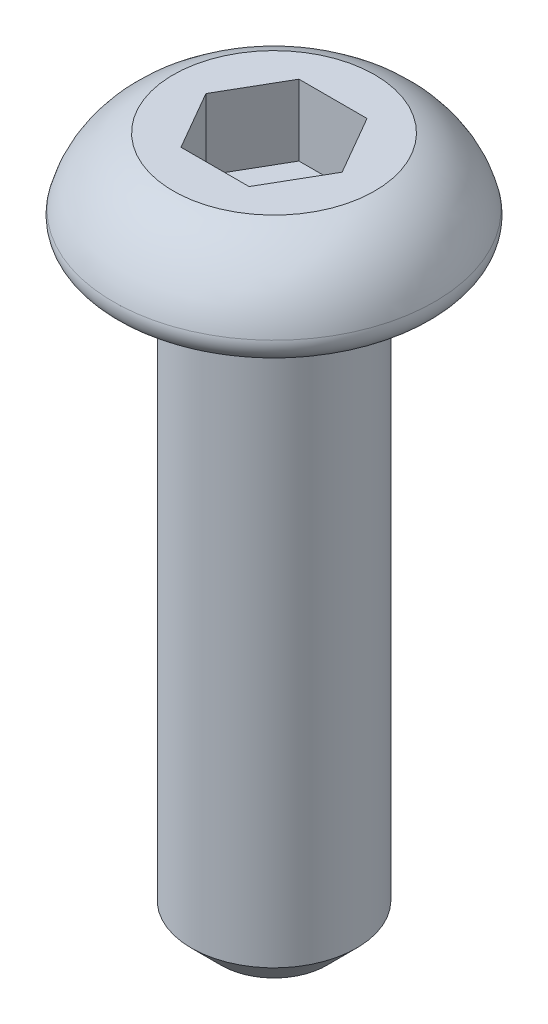
ISO-10303-21;
HEADER;
FILE_DESCRIPTION(('STEP AP214'),'2;1');
FILE_NAME('part.step','',(''),(''),'','','');
FILE_SCHEMA(('AUTOMOTIVE_DESIGN { 1 0 10303 214 1 1 1 1 }'));
ENDSEC;
DATA;
#1=APPLICATION_CONTEXT('core data for automotive mechanical design processes');
#2=APPLICATION_PROTOCOL_DEFINITION('international standard','automotive_design',2000,#1);
#3=PRODUCT_CONTEXT('',#1,'mechanical');
#4=PRODUCT('Part','Part','',(#3));
#5=PRODUCT_RELATED_PRODUCT_CATEGORY('part','',(#4));
#6=PRODUCT_DEFINITION_FORMATION('','',#4);
#7=PRODUCT_DEFINITION_CONTEXT('part definition',#1,'design');
#8=PRODUCT_DEFINITION('design','',#6,#7);
#9=PRODUCT_DEFINITION_SHAPE('','',#8);
#10=(LENGTH_UNIT() NAMED_UNIT(*) SI_UNIT(.MILLI.,.METRE.));
#11=(NAMED_UNIT(*) PLANE_ANGLE_UNIT() SI_UNIT($,.RADIAN.));
#12=(NAMED_UNIT(*) SI_UNIT($,.STERADIAN.) SOLID_ANGLE_UNIT());
#13=UNCERTAINTY_MEASURE_WITH_UNIT(LENGTH_MEASURE(1.E-05),#10,'distance_accuracy_value','');
#14=(GEOMETRIC_REPRESENTATION_CONTEXT(3) GLOBAL_UNCERTAINTY_ASSIGNED_CONTEXT((#13)) GLOBAL_UNIT_ASSIGNED_CONTEXT((#10,
#11,#12)) REPRESENTATION_CONTEXT('',''));
#15=CARTESIAN_POINT('',(0.,0.,0.));
#16=DIRECTION('',(0.,0.,1.));
#17=DIRECTION('',(1.,0.,0.));
#18=AXIS2_PLACEMENT_3D('',#15,#16,#17);
#19=CARTESIAN_POINT('',(0.,0.304800000000001,0.));
#20=DIRECTION('',(0.,1.,0.));
#21=DIRECTION('',(-1.,0.,0.));
#22=AXIS2_PLACEMENT_3D('',#19,#20,#21);
#23=PLANE('',#22);
#24=DIRECTION('',(-0.5,0.,0.866025403784439));
#25=VECTOR('',#24,1.);
#26=CARTESIAN_POINT('',(-0.536574999999999,0.304800000000001,-0.92937516207127));
#27=LINE('',#26,#25);
#28=CARTESIAN_POINT('',(-0.536574999999999,0.304800000000001,-0.929375162071269));
#29=VERTEX_POINT('',#28);
#30=CARTESIAN_POINT('',(-1.07315,0.304800000000001,0.));
#31=VERTEX_POINT('',#30);
#32=EDGE_CURVE('E148',#29,#31,#27,.T.);
#33=ORIENTED_EDGE('',*,*,#32,.T.);
#34=DIRECTION('',(0.5,0.,0.866025403784439));
#35=VECTOR('',#34,1.);
#36=CARTESIAN_POINT('',(-1.07315,0.304800000000001,0.));
#37=LINE('',#36,#35);
#38=CARTESIAN_POINT('',(-0.536575000000001,0.304800000000001,0.92937516207127));
#39=VERTEX_POINT('',#38);
#40=EDGE_CURVE('E143',#31,#39,#37,.T.);
#41=ORIENTED_EDGE('',*,*,#40,.T.);
#42=DIRECTION('',(1.,0.,0.));
#43=VECTOR('',#42,1.);
#44=CARTESIAN_POINT('',(-0.536574999999999,0.304800000000001,0.929375162071269));
#45=LINE('',#44,#43);
#46=CARTESIAN_POINT('',(0.536574999999999,0.304800000000001,0.929375162071269));
#47=VERTEX_POINT('',#46);
#48=EDGE_CURVE('E82',#39,#47,#45,.T.);
#49=ORIENTED_EDGE('',*,*,#48,.T.);
#50=DIRECTION('',(0.5,0.,-0.866025403784439));
#51=VECTOR('',#50,1.);
#52=CARTESIAN_POINT('',(0.536574999999999,0.304800000000001,0.929375162071269));
#53=LINE('',#52,#51);
#54=CARTESIAN_POINT('',(1.07315,0.304800000000001,0.));
#55=VERTEX_POINT('',#54);
#56=EDGE_CURVE('E79',#47,#55,#53,.T.);
#57=ORIENTED_EDGE('',*,*,#56,.T.);
#58=DIRECTION('',(-0.5,0.,-0.866025403784439));
#59=VECTOR('',#58,1.);
#60=CARTESIAN_POINT('',(1.07315,0.304800000000001,0.));
#61=LINE('',#60,#59);
#62=CARTESIAN_POINT('',(0.536575000000001,0.304800000000001,-0.929375162071269));
#63=VERTEX_POINT('',#62);
#64=EDGE_CURVE('E76',#55,#63,#61,.T.);
#65=ORIENTED_EDGE('',*,*,#64,.T.);
#66=DIRECTION('',(-1.,0.,0.));
#67=VECTOR('',#66,1.);
#68=CARTESIAN_POINT('',(0.536574999999999,0.304800000000001,-0.929375162071269));
#69=LINE('',#68,#67);
#70=EDGE_CURVE('E99',#63,#29,#69,.T.);
#71=ORIENTED_EDGE('',*,*,#70,.T.);
#72=EDGE_LOOP('',(#33,#41,#49,#57,#65,#71));
#73=FACE_BOUND('',#72,.T.);
#74=ADVANCED_FACE('F24',(#73),#23,.T.);
#75=CARTESIAN_POINT('',(0.536575000000001,1.4224,0.929375162071269));
#76=DIRECTION('',(0.866025403784439,0.,0.5));
#77=DIRECTION('',(0.5,0.,-0.866025403784439));
#78=AXIS2_PLACEMENT_3D('',#75,#76,#77);
#79=PLANE('',#78);
#80=DIRECTION('',(0.,1.,0.));
#81=VECTOR('',#80,1.);
#82=CARTESIAN_POINT('',(1.07315,1.4224,0.));
#83=LINE('',#82,#81);
#84=CARTESIAN_POINT('',(1.07315,1.4224,0.));
#85=VERTEX_POINT('',#84);
#86=EDGE_CURVE('E85',#85,#55,#83,.F.);
#87=ORIENTED_EDGE('',*,*,#86,.T.);
#88=ORIENTED_EDGE('',*,*,#56,.F.);
#89=DIRECTION('',(0.,1.,0.));
#90=VECTOR('',#89,1.);
#91=CARTESIAN_POINT('',(0.536575000000001,1.4224,0.929375162071269));
#92=LINE('',#91,#90);
#93=CARTESIAN_POINT('',(0.536575000000001,1.4224,0.929375162071269));
#94=VERTEX_POINT('',#93);
#95=EDGE_CURVE('E138',#47,#94,#92,.T.);
#96=ORIENTED_EDGE('',*,*,#95,.T.);
#97=DIRECTION('',(0.5,0.,-0.866025403784438));
#98=VECTOR('',#97,1.);
#99=CARTESIAN_POINT('',(0.536575000000001,1.4224,0.929375162071269));
#100=LINE('',#99,#98);
#101=EDGE_CURVE('E90',#94,#85,#100,.T.);
#102=ORIENTED_EDGE('',*,*,#101,.T.);
#103=EDGE_LOOP('',(#87,#88,#96,#102));
#104=FACE_BOUND('',#103,.T.);
#105=ADVANCED_FACE('F88',(#104),#79,.F.);
#106=CARTESIAN_POINT('',(1.07315,1.4224,0.));
#107=DIRECTION('',(0.866025403784439,0.,-0.5));
#108=DIRECTION('',(-0.5,0.,-0.866025403784439));
#109=AXIS2_PLACEMENT_3D('',#106,#107,#108);
#110=PLANE('',#109);
#111=DIRECTION('',(0.,1.,0.));
#112=VECTOR('',#111,1.);
#113=CARTESIAN_POINT('',(0.536575000000001,1.4224,-0.929375162071269));
#114=LINE('',#113,#112);
#115=CARTESIAN_POINT('',(0.536575000000001,1.4224,-0.92937516207127));
#116=VERTEX_POINT('',#115);
#117=EDGE_CURVE('E96',#116,#63,#114,.F.);
#118=ORIENTED_EDGE('',*,*,#117,.T.);
#119=ORIENTED_EDGE('',*,*,#64,.F.);
#120=ORIENTED_EDGE('',*,*,#86,.F.);
#121=DIRECTION('',(-0.5,0.,-0.866025403784438));
#122=VECTOR('',#121,1.);
#123=CARTESIAN_POINT('',(1.07315,1.4224,0.));
#124=LINE('',#123,#122);
#125=EDGE_CURVE('E135',#85,#116,#124,.T.);
#126=ORIENTED_EDGE('',*,*,#125,.T.);
#127=EDGE_LOOP('',(#118,#119,#120,#126));
#128=FACE_BOUND('',#127,.T.);
#129=ADVANCED_FACE('F94',(#128),#110,.F.);
#130=CARTESIAN_POINT('',(0.536575000000001,1.4224,-0.929375162071269));
#131=DIRECTION('',(0.,0.,-1.));
#132=DIRECTION('',(-1.,0.,0.));
#133=AXIS2_PLACEMENT_3D('',#130,#131,#132);
#134=PLANE('',#133);
#135=DIRECTION('',(0.,1.,0.));
#136=VECTOR('',#135,1.);
#137=CARTESIAN_POINT('',(-0.536574999999999,1.4224,-0.929375162071269));
#138=LINE('',#137,#136);
#139=CARTESIAN_POINT('',(-0.536574999999999,1.4224,-0.929375162071269));
#140=VERTEX_POINT('',#139);
#141=EDGE_CURVE('E150',#140,#29,#138,.F.);
#142=ORIENTED_EDGE('',*,*,#141,.T.);
#143=ORIENTED_EDGE('',*,*,#70,.F.);
#144=ORIENTED_EDGE('',*,*,#117,.F.);
#145=DIRECTION('',(1.,0.,0.));
#146=VECTOR('',#145,1.);
#147=CARTESIAN_POINT('',(0.,1.4224,-0.929375162071269));
#148=LINE('',#147,#146);
#149=EDGE_CURVE('E133',#116,#140,#148,.F.);
#150=ORIENTED_EDGE('',*,*,#149,.T.);
#151=EDGE_LOOP('',(#142,#143,#144,#150));
#152=FACE_BOUND('',#151,.T.);
#153=ADVANCED_FACE('F155',(#152),#134,.F.);
#154=CARTESIAN_POINT('',(-0.536574999999999,1.4224,-0.929375162071269));
#155=DIRECTION('',(-0.866025403784439,0.,-0.5));
#156=DIRECTION('',(-0.5,0.,0.866025403784439));
#157=AXIS2_PLACEMENT_3D('',#154,#155,#156);
#158=PLANE('',#157);
#159=DIRECTION('',(0.,1.,0.));
#160=VECTOR('',#159,1.);
#161=CARTESIAN_POINT('',(-1.07315,1.4224,0.));
#162=LINE('',#161,#160);
#163=CARTESIAN_POINT('',(-1.07315,1.4224,0.));
#164=VERTEX_POINT('',#163);
#165=EDGE_CURVE('E145',#164,#31,#162,.F.);
#166=ORIENTED_EDGE('',*,*,#165,.T.);
#167=ORIENTED_EDGE('',*,*,#32,.F.);
#168=ORIENTED_EDGE('',*,*,#141,.F.);
#169=DIRECTION('',(-0.5,0.,0.866025403784438));
#170=VECTOR('',#169,1.);
#171=CARTESIAN_POINT('',(-0.536574999999999,1.4224,-0.929375162071269));
#172=LINE('',#171,#170);
#173=EDGE_CURVE('E131',#140,#164,#172,.T.);
#174=ORIENTED_EDGE('',*,*,#173,.T.);
#175=EDGE_LOOP('',(#166,#167,#168,#174));
#176=FACE_BOUND('',#175,.T.);
#177=ADVANCED_FACE('F159',(#176),#158,.F.);
#178=CARTESIAN_POINT('',(-1.07315,1.4224,0.));
#179=DIRECTION('',(-0.866025403784439,0.,0.5));
#180=DIRECTION('',(0.5,0.,0.866025403784439));
#181=AXIS2_PLACEMENT_3D('',#178,#179,#180);
#182=PLANE('',#181);
#183=DIRECTION('',(0.,1.,0.));
#184=VECTOR('',#183,1.);
#185=CARTESIAN_POINT('',(-0.536574999999999,1.4224,0.929375162071269));
#186=LINE('',#185,#184);
#187=CARTESIAN_POINT('',(-0.536574999999999,1.4224,0.92937516207127));
#188=VERTEX_POINT('',#187);
#189=EDGE_CURVE('E141',#188,#39,#186,.F.);
#190=ORIENTED_EDGE('',*,*,#189,.T.);
#191=ORIENTED_EDGE('',*,*,#40,.F.);
#192=ORIENTED_EDGE('',*,*,#165,.F.);
#193=DIRECTION('',(0.5,0.,0.866025403784438));
#194=VECTOR('',#193,1.);
#195=CARTESIAN_POINT('',(-1.07315,1.4224,0.));
#196=LINE('',#195,#194);
#197=EDGE_CURVE('E43',#164,#188,#196,.T.);
#198=ORIENTED_EDGE('',*,*,#197,.T.);
#199=EDGE_LOOP('',(#190,#191,#192,#198));
#200=FACE_BOUND('',#199,.T.);
#201=ADVANCED_FACE('F161',(#200),#182,.F.);
#202=CARTESIAN_POINT('',(-0.536574999999999,1.4224,0.929375162071269));
#203=DIRECTION('',(0.,0.,1.));
#204=DIRECTION('',(1.,0.,0.));
#205=AXIS2_PLACEMENT_3D('',#202,#203,#204);
#206=PLANE('',#205);
#207=ORIENTED_EDGE('',*,*,#95,.F.);
#208=ORIENTED_EDGE('',*,*,#48,.F.);
#209=ORIENTED_EDGE('',*,*,#189,.F.);
#210=DIRECTION('',(1.,0.,0.));
#211=VECTOR('',#210,1.);
#212=CARTESIAN_POINT('',(0.,1.4224,0.929375162071269));
#213=LINE('',#212,#211);
#214=EDGE_CURVE('E119',#188,#94,#213,.T.);
#215=ORIENTED_EDGE('',*,*,#214,.T.);
#216=EDGE_LOOP('',(#207,#208,#209,#215));
#217=FACE_BOUND('',#216,.T.);
#218=ADVANCED_FACE('F164',(#217),#206,.F.);
#219=CARTESIAN_POINT('',(0.,1.4224,0.));
#220=DIRECTION('',(0.,-1.,0.));
#221=DIRECTION('',(1.,0.,0.));
#222=AXIS2_PLACEMENT_3D('',#219,#220,#221);
#223=PLANE('',#222);
#224=ORIENTED_EDGE('',*,*,#197,.F.);
#225=ORIENTED_EDGE('',*,*,#173,.F.);
#226=ORIENTED_EDGE('',*,*,#149,.F.);
#227=ORIENTED_EDGE('',*,*,#125,.F.);
#228=ORIENTED_EDGE('',*,*,#101,.F.);
#229=ORIENTED_EDGE('',*,*,#214,.F.);
#230=EDGE_LOOP('',(#224,#225,#226,#227,#228,#229));
#231=FACE_BOUND('',#230,.T.);
#232=CARTESIAN_POINT('',(0.,1.4224,0.));
#233=DIRECTION('',(0.,-1.,0.));
#234=DIRECTION('',(0.,0.,-1.));
#235=AXIS2_PLACEMENT_3D('',#232,#233,#234);
#236=CIRCLE('',#235,1.5875);
#237=CARTESIAN_POINT('',(0.,1.4224,-1.5875));
#238=VERTEX_POINT('',#237);
#239=EDGE_CURVE('E28',#238,#238,#236,.F.);
#240=ORIENTED_EDGE('',*,*,#239,.T.);
#241=EDGE_LOOP('',(#240));
#242=FACE_BOUND('',#241,.T.);
#243=ADVANCED_FACE('F166',(#231,#242),#223,.F.);
#244=CARTESIAN_POINT('',(0.,0.,0.));
#245=DIRECTION('',(0.,-1.,0.));
#246=DIRECTION('',(0.,0.,-1.));
#247=AXIS2_PLACEMENT_3D('',#244,#245,#246);
#248=DEGENERATE_TOROIDAL_SURFACE('',#247,1.06278727428776,1.51609538107745,.T.);
#249=ORIENTED_EDGE('',*,*,#239,.F.);
#250=EDGE_LOOP('',(#249));
#251=FACE_BOUND('',#250,.T.);
#252=CARTESIAN_POINT('',(0.,0.380999999999999,0.));
#253=DIRECTION('',(0.,-1.,0.));
#254=DIRECTION('',(0.,0.,-1.));
#255=AXIS2_PLACEMENT_3D('',#252,#253,#254);
#256=CIRCLE('',#255,2.53022865455628);
#257=CARTESIAN_POINT('',(0.,0.380999999999999,-2.53022865455628));
#258=VERTEX_POINT('',#257);
#259=EDGE_CURVE('E110',#258,#258,#256,.T.);
#260=ORIENTED_EDGE('',*,*,#259,.F.);
#261=EDGE_LOOP('',(#260));
#262=FACE_BOUND('',#261,.T.);
#263=ADVANCED_FACE('F26',(#251,#262),#248,.T.);
#264=CARTESIAN_POINT('',(0.,0.304482497797472,0.));
#265=DIRECTION('',(0.,-1.,0.));
#266=DIRECTION('',(0.,0.,-1.));
#267=AXIS2_PLACEMENT_3D('',#264,#265,#266);
#268=TOROIDAL_SURFACE('',#267,2.23551750220253,0.304482497797472);
#269=CARTESIAN_POINT('',(0.,0.,0.));
#270=DIRECTION('',(0.,1.,0.));
#271=DIRECTION('',(-1.,0.,0.));
#272=AXIS2_PLACEMENT_3D('',#269,#270,#271);
#273=CIRCLE('',#272,2.23551750220253);
#274=CARTESIAN_POINT('',(-2.23551750220253,0.,0.));
#275=VERTEX_POINT('',#274);
#276=EDGE_CURVE('E105',#275,#275,#273,.F.);
#277=ORIENTED_EDGE('',*,*,#276,.F.);
#278=EDGE_LOOP('',(#277));
#279=FACE_BOUND('',#278,.T.);
#280=ORIENTED_EDGE('',*,*,#259,.T.);
#281=EDGE_LOOP('',(#280));
#282=FACE_BOUND('',#281,.T.);
#283=ADVANCED_FACE('F174',(#279,#282),#268,.T.);
#284=CARTESIAN_POINT('',(0.,-9.525,0.));
#285=DIRECTION('',(0.,1.,0.));
#286=DIRECTION('',(0.,0.,1.));
#287=AXIS2_PLACEMENT_3D('',#284,#285,#286);
#288=PLANE('',#287);
#289=CARTESIAN_POINT('',(0.,-9.52499999999645,0.));
#290=DIRECTION('',(0.,1.,0.));
#291=DIRECTION('',(0.,0.,1.));
#292=AXIS2_PLACEMENT_3D('',#289,#290,#291);
#293=CIRCLE('',#292,0.829310000028727);
#294=CARTESIAN_POINT('',(0.,-9.52499999999645,0.829310000028727));
#295=VERTEX_POINT('',#294);
#296=EDGE_CURVE('E102',#295,#295,#293,.T.);
#297=ORIENTED_EDGE('',*,*,#296,.F.);
#298=EDGE_LOOP('',(#297));
#299=FACE_BOUND('',#298,.T.);
#300=ADVANCED_FACE('F179',(#299),#288,.F.);
#301=CARTESIAN_POINT('',(0.,0.,0.));
#302=DIRECTION('',(0.,-1.,0.));
#303=DIRECTION('',(1.,0.,0.));
#304=AXIS2_PLACEMENT_3D('',#301,#302,#303);
#305=PLANE('',#304);
#306=CARTESIAN_POINT('',(0.,0.,0.));
#307=DIRECTION('',(0.,-1.,0.));
#308=DIRECTION('',(-1.,0.,1.73654343881523E-13));
#309=AXIS2_PLACEMENT_3D('',#306,#307,#308);
#310=CIRCLE('',#309,1.55575);
#311=CARTESIAN_POINT('',(-1.55575,0.,2.70162745493679E-13));
#312=VERTEX_POINT('',#311);
#313=EDGE_CURVE('E104',#312,#312,#310,.F.);
#314=ORIENTED_EDGE('',*,*,#313,.T.);
#315=EDGE_LOOP('',(#314));
#316=FACE_BOUND('',#315,.T.);
#317=ORIENTED_EDGE('',*,*,#276,.T.);
#318=EDGE_LOOP('',(#317));
#319=FACE_BOUND('',#318,.T.);
#320=ADVANCED_FACE('F207',(#316,#319),#305,.T.);
#321=CARTESIAN_POINT('',(0.,-9.05256000010013,0.));
#322=DIRECTION('',(0.,1.,0.));
#323=DIRECTION('',(0.,0.,1.));
#324=AXIS2_PLACEMENT_3D('',#321,#322,#323);
#325=CONICAL_SURFACE('',#324,1.30174999992505,0.785398163397448);
#326=CARTESIAN_POINT('',(0.,-9.05256,0.));
#327=DIRECTION('',(0.,1.,0.));
#328=DIRECTION('',(0.,0.,1.));
#329=AXIS2_PLACEMENT_3D('',#326,#327,#328);
#330=CIRCLE('',#329,1.30175);
#331=CARTESIAN_POINT('',(0.,-9.05256,1.30175));
#332=VERTEX_POINT('',#331);
#333=EDGE_CURVE('E34',#332,#332,#330,.T.);
#334=ORIENTED_EDGE('',*,*,#333,.F.);
#335=EDGE_LOOP('',(#334));
#336=FACE_BOUND('',#335,.T.);
#337=ORIENTED_EDGE('',*,*,#296,.T.);
#338=EDGE_LOOP('',(#337));
#339=FACE_BOUND('',#338,.T.);
#340=ADVANCED_FACE('F189',(#336,#339),#325,.T.);
#341=CARTESIAN_POINT('',(0.,-0.253999999999997,0.));
#342=DIRECTION('',(0.,1.,0.));
#343=DIRECTION('',(0.,0.,1.));
#344=AXIS2_PLACEMENT_3D('',#341,#342,#343);
#345=TOROIDAL_SURFACE('',#344,1.55575,0.254);
#346=ORIENTED_EDGE('',*,*,#313,.F.);
#347=EDGE_LOOP('',(#346));
#348=FACE_BOUND('',#347,.T.);
#349=CARTESIAN_POINT('',(0.,-0.253999999999997,0.));
#350=DIRECTION('',(0.,1.,0.));
#351=DIRECTION('',(0.,0.,1.));
#352=AXIS2_PLACEMENT_3D('',#349,#350,#351);
#353=CIRCLE('',#352,1.30175);
#354=CARTESIAN_POINT('',(0.,-0.253999999999997,1.30175));
#355=VERTEX_POINT('',#354);
#356=EDGE_CURVE('E13',#355,#355,#353,.F.);
#357=ORIENTED_EDGE('',*,*,#356,.F.);
#358=EDGE_LOOP('',(#357));
#359=FACE_BOUND('',#358,.T.);
#360=ADVANCED_FACE('F183',(#348,#359),#345,.F.);
#361=CARTESIAN_POINT('',(0.,0.,0.));
#362=DIRECTION('',(0.,1.,0.));
#363=DIRECTION('',(0.,0.,1.));
#364=AXIS2_PLACEMENT_3D('',#361,#362,#363);
#365=CYLINDRICAL_SURFACE('',#364,1.30175);
#366=ORIENTED_EDGE('',*,*,#356,.T.);
#367=EDGE_LOOP('',(#366));
#368=FACE_BOUND('',#367,.T.);
#369=ORIENTED_EDGE('',*,*,#333,.T.);
#370=EDGE_LOOP('',(#369));
#371=FACE_BOUND('',#370,.T.);
#372=ADVANCED_FACE('F181',(#368,#371),#365,.T.);
#373=CLOSED_SHELL('',(#74,#105,#129,#153,#177,#201,#218,#243,#263,#283,#300,#320,#340,#360,#372));
#374=MANIFOLD_SOLID_BREP('B1',#373);
#375=ADVANCED_BREP_SHAPE_REPRESENTATION('',(#18,#374),#14);
#376=SHAPE_DEFINITION_REPRESENTATION(#9,#375);
ENDSEC;
END-ISO-10303-21;
